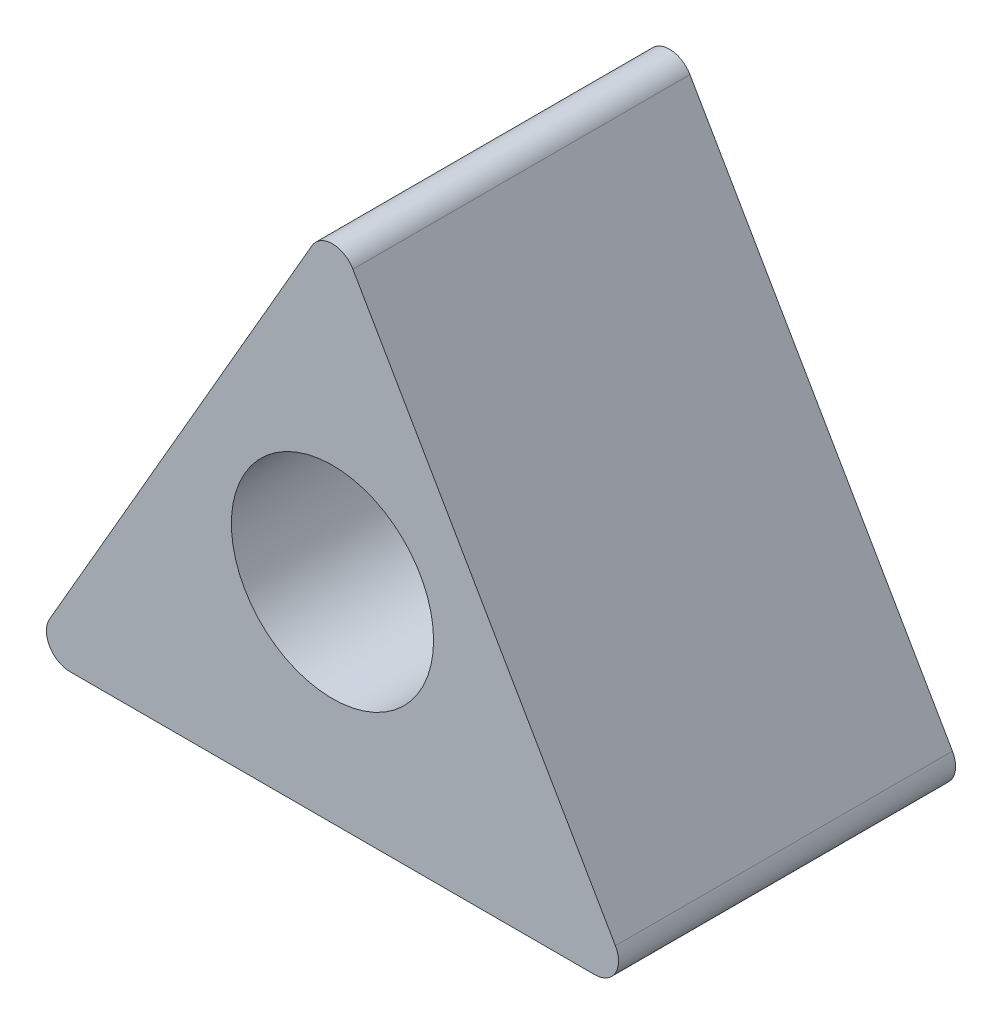
ISO-10303-21;
HEADER;
FILE_DESCRIPTION(('STEP AP214'),'2;1');
FILE_NAME('part.step','',(''),(''),'','','');
FILE_SCHEMA(('AUTOMOTIVE_DESIGN { 1 0 10303 214 1 1 1 1 }'));
ENDSEC;
DATA;
#1=APPLICATION_CONTEXT('core data for automotive mechanical design processes');
#2=APPLICATION_PROTOCOL_DEFINITION('international standard','automotive_design',2000,#1);
#3=PRODUCT_CONTEXT('',#1,'mechanical');
#4=PRODUCT('Part','Part','',(#3));
#5=PRODUCT_RELATED_PRODUCT_CATEGORY('part','',(#4));
#6=PRODUCT_DEFINITION_FORMATION('','',#4);
#7=PRODUCT_DEFINITION_CONTEXT('part definition',#1,'design');
#8=PRODUCT_DEFINITION('design','',#6,#7);
#9=PRODUCT_DEFINITION_SHAPE('','',#8);
#10=(LENGTH_UNIT() NAMED_UNIT(*) SI_UNIT(.MILLI.,.METRE.));
#11=(NAMED_UNIT(*) PLANE_ANGLE_UNIT() SI_UNIT($,.RADIAN.));
#12=(NAMED_UNIT(*) SI_UNIT($,.STERADIAN.) SOLID_ANGLE_UNIT());
#13=UNCERTAINTY_MEASURE_WITH_UNIT(LENGTH_MEASURE(1.E-05),#10,'distance_accuracy_value','');
#14=(GEOMETRIC_REPRESENTATION_CONTEXT(3) GLOBAL_UNCERTAINTY_ASSIGNED_CONTEXT((#13)) GLOBAL_UNIT_ASSIGNED_CONTEXT((#10,
#11,#12)) REPRESENTATION_CONTEXT('',''));
#15=CARTESIAN_POINT('',(0.,0.,0.));
#16=DIRECTION('',(0.,0.,1.));
#17=DIRECTION('',(1.,0.,0.));
#18=AXIS2_PLACEMENT_3D('',#15,#16,#17);
#19=CARTESIAN_POINT('',(0.,0.,50.));
#20=DIRECTION('',(0.,0.,-1.));
#21=DIRECTION('',(-1.,0.,0.));
#22=AXIS2_PLACEMENT_3D('',#19,#20,#21);
#23=PLANE('',#22);
#24=DIRECTION('',(-0.499989161803219,-0.866031661129843,0.));
#25=VECTOR('',#24,1.);
#26=CARTESIAN_POINT('',(0.,0.,50.));
#27=LINE('',#26,#25);
#28=CARTESIAN_POINT('',(41.9680013521204,72.6928115685453,50.));
#29=VERTEX_POINT('',#28);
#30=CARTESIAN_POINT('',(3.03102321016933,5.25003793314056,50.));
#31=VERTEX_POINT('',#30);
#32=EDGE_CURVE('E104',#29,#31,#27,.T.);
#33=ORIENTED_EDGE('',*,*,#32,.T.);
#34=CARTESIAN_POINT('',(6.06213402412378,3.50007586682929,50.));
#35=DIRECTION('',(0.,0.,-1.));
#36=DIRECTION('',(-1.,0.,0.));
#37=AXIS2_PLACEMENT_3D('',#34,#35,#36);
#38=CIRCLE('',#37,3.5);
#39=CARTESIAN_POINT('',(6.06217782601634,7.58671033804374E-05,50.));
#40=VERTEX_POINT('',#39);
#41=EDGE_CURVE('E11',#31,#40,#38,.F.);
#42=ORIENTED_EDGE('',*,*,#41,.T.);
#43=DIRECTION('',(0.999999999921689,1.25148264455236E-05,0.));
#44=VECTOR('',#43,1.);
#45=CARTESIAN_POINT('',(0.,0.,50.));
#46=LINE('',#45,#44);
#47=CARTESIAN_POINT('',(83.9378221669357,0.00105046727671669,50.));
#48=VERTEX_POINT('',#47);
#49=EDGE_CURVE('E142',#40,#48,#46,.T.);
#50=ORIENTED_EDGE('',*,*,#49,.T.);
#51=CARTESIAN_POINT('',(83.9377783650432,3.50105046700264,50.));
#52=DIRECTION('',(0.,0.,-1.));
#53=DIRECTION('',(-1.,0.,0.));
#54=AXIS2_PLACEMENT_3D('',#51,#52,#53);
#55=CIRCLE('',#54,3.5);
#56=CARTESIAN_POINT('',(86.968845377105,5.2510884004173,50.));
#57=VERTEX_POINT('',#56);
#58=EDGE_CURVE('E133',#48,#57,#55,.F.);
#59=ORIENTED_EDGE('',*,*,#58,.T.);
#60=DIRECTION('',(-0.500010838118471,0.866019146303397,0.));
#61=VECTOR('',#60,1.);
#62=CARTESIAN_POINT('',(44.9990245622897,77.9428495016858,50.));
#63=LINE('',#62,#61);
#64=CARTESIAN_POINT('',(48.0301791781367,72.6928874356487,50.));
#65=VERTEX_POINT('',#64);
#66=EDGE_CURVE('E105',#57,#65,#63,.T.);
#67=ORIENTED_EDGE('',*,*,#66,.T.);
#68=CARTESIAN_POINT('',(44.9991121660748,70.942849502234,50.));
#69=DIRECTION('',(0.,0.,-1.));
#70=DIRECTION('',(-1.,0.,0.));
#71=AXIS2_PLACEMENT_3D('',#68,#69,#70);
#72=CIRCLE('',#71,3.5);
#73=EDGE_CURVE('E122',#65,#29,#72,.F.);
#74=ORIENTED_EDGE('',*,*,#73,.T.);
#75=EDGE_LOOP('',(#33,#42,#50,#59,#67,#74));
#76=FACE_BOUND('',#75,.T.);
#77=CARTESIAN_POINT('',(45.,31.,50.));
#78=DIRECTION('',(0.,0.,1.));
#79=DIRECTION('',(1.,0.,0.));
#80=AXIS2_PLACEMENT_3D('',#77,#78,#79);
#81=CIRCLE('',#80,15.);
#82=CARTESIAN_POINT('',(60.,31.,50.));
#83=VERTEX_POINT('',#82);
#84=EDGE_CURVE('E110',#83,#83,#81,.T.);
#85=ORIENTED_EDGE('',*,*,#84,.F.);
#86=EDGE_LOOP('',(#85));
#87=FACE_BOUND('',#86,.T.);
#88=ADVANCED_FACE('F39',(#76,#87),#23,.F.);
#89=CARTESIAN_POINT('',(0.,0.,0.));
#90=DIRECTION('',(0.,0.,-1.));
#91=DIRECTION('',(-1.,0.,0.));
#92=AXIS2_PLACEMENT_3D('',#89,#90,#91);
#93=PLANE('',#92);
#94=DIRECTION('',(0.999999999921689,1.25148264455236E-05,0.));
#95=VECTOR('',#94,1.);
#96=CARTESIAN_POINT('',(0.,0.,0.));
#97=LINE('',#96,#95);
#98=CARTESIAN_POINT('',(6.06217782601634,7.58671033804374E-05,0.));
#99=VERTEX_POINT('',#98);
#100=CARTESIAN_POINT('',(83.9378221669357,0.00105046727671669,0.));
#101=VERTEX_POINT('',#100);
#102=EDGE_CURVE('E109',#99,#101,#97,.T.);
#103=ORIENTED_EDGE('',*,*,#102,.F.);
#104=CARTESIAN_POINT('',(6.06213402412378,3.50007586682929,0.));
#105=DIRECTION('',(0.,0.,-1.));
#106=DIRECTION('',(-1.,0.,0.));
#107=AXIS2_PLACEMENT_3D('',#104,#105,#106);
#108=CIRCLE('',#107,3.5);
#109=CARTESIAN_POINT('',(3.03102321016933,5.25003793314056,0.));
#110=VERTEX_POINT('',#109);
#111=EDGE_CURVE('E61',#99,#110,#108,.T.);
#112=ORIENTED_EDGE('',*,*,#111,.T.);
#113=DIRECTION('',(-0.499989161803219,-0.866031661129843,0.));
#114=VECTOR('',#113,1.);
#115=CARTESIAN_POINT('',(0.,0.,0.));
#116=LINE('',#115,#114);
#117=CARTESIAN_POINT('',(41.9680013521204,72.6928115685453,0.));
#118=VERTEX_POINT('',#117);
#119=EDGE_CURVE('E103',#118,#110,#116,.T.);
#120=ORIENTED_EDGE('',*,*,#119,.F.);
#121=CARTESIAN_POINT('',(44.9991121660748,70.942849502234,0.));
#122=DIRECTION('',(0.,0.,-1.));
#123=DIRECTION('',(-1.,0.,0.));
#124=AXIS2_PLACEMENT_3D('',#121,#122,#123);
#125=CIRCLE('',#124,3.5);
#126=CARTESIAN_POINT('',(48.0301791781367,72.6928874356487,0.));
#127=VERTEX_POINT('',#126);
#128=EDGE_CURVE('E93',#118,#127,#125,.T.);
#129=ORIENTED_EDGE('',*,*,#128,.T.);
#130=DIRECTION('',(-0.500010838118471,0.866019146303397,0.));
#131=VECTOR('',#130,1.);
#132=CARTESIAN_POINT('',(44.9990245622897,77.9428495016858,0.));
#133=LINE('',#132,#131);
#134=CARTESIAN_POINT('',(86.968845377105,5.2510884004173,0.));
#135=VERTEX_POINT('',#134);
#136=EDGE_CURVE('E112',#135,#127,#133,.T.);
#137=ORIENTED_EDGE('',*,*,#136,.F.);
#138=CARTESIAN_POINT('',(83.9377783650432,3.50105046700264,0.));
#139=DIRECTION('',(0.,0.,-1.));
#140=DIRECTION('',(-1.,0.,0.));
#141=AXIS2_PLACEMENT_3D('',#138,#139,#140);
#142=CIRCLE('',#141,3.5);
#143=EDGE_CURVE('E127',#135,#101,#142,.T.);
#144=ORIENTED_EDGE('',*,*,#143,.T.);
#145=EDGE_LOOP('',(#103,#112,#120,#129,#137,#144));
#146=FACE_BOUND('',#145,.T.);
#147=CARTESIAN_POINT('',(45.,31.,0.));
#148=DIRECTION('',(0.,0.,1.));
#149=DIRECTION('',(1.,0.,0.));
#150=AXIS2_PLACEMENT_3D('',#147,#148,#149);
#151=CIRCLE('',#150,15.);
#152=CARTESIAN_POINT('',(60.,31.,0.));
#153=VERTEX_POINT('',#152);
#154=EDGE_CURVE('E115',#153,#153,#151,.T.);
#155=ORIENTED_EDGE('',*,*,#154,.T.);
#156=EDGE_LOOP('',(#155));
#157=FACE_BOUND('',#156,.T.);
#158=ADVANCED_FACE('F107',(#146,#157),#93,.T.);
#159=CARTESIAN_POINT('',(0.,0.,50.));
#160=DIRECTION('',(0.866031661129843,-0.499989161803219,0.));
#161=DIRECTION('',(0.499989161803219,0.866031661129843,0.));
#162=AXIS2_PLACEMENT_3D('',#159,#160,#161);
#163=PLANE('',#162);
#164=ORIENTED_EDGE('',*,*,#119,.T.);
#165=DIRECTION('',(0.,0.,-1.));
#166=VECTOR('',#165,1.);
#167=CARTESIAN_POINT('',(3.03102321016933,5.25003793314056,50.));
#168=LINE('',#167,#166);
#169=EDGE_CURVE('E47',#110,#31,#168,.F.);
#170=ORIENTED_EDGE('',*,*,#169,.T.);
#171=ORIENTED_EDGE('',*,*,#32,.F.);
#172=DIRECTION('',(0.,0.,-1.));
#173=VECTOR('',#172,1.);
#174=CARTESIAN_POINT('',(41.9680013521204,72.6928115685453,50.));
#175=LINE('',#174,#173);
#176=EDGE_CURVE('E97',#29,#118,#175,.T.);
#177=ORIENTED_EDGE('',*,*,#176,.T.);
#178=EDGE_LOOP('',(#164,#170,#171,#177));
#179=FACE_BOUND('',#178,.T.);
#180=ADVANCED_FACE('F102',(#179),#163,.F.);
#181=CARTESIAN_POINT('',(0.,0.,50.));
#182=DIRECTION('',(-1.25148264455236E-05,0.99999999992169,0.));
#183=DIRECTION('',(-0.99999999992169,-1.25148264455236E-05,0.));
#184=AXIS2_PLACEMENT_3D('',#181,#182,#183);
#185=PLANE('',#184);
#186=ORIENTED_EDGE('',*,*,#49,.F.);
#187=DIRECTION('',(0.,0.,-1.));
#188=VECTOR('',#187,1.);
#189=CARTESIAN_POINT('',(6.06217782601634,7.58671033804374E-05,50.));
#190=LINE('',#189,#188);
#191=EDGE_CURVE('E135',#40,#99,#190,.T.);
#192=ORIENTED_EDGE('',*,*,#191,.T.);
#193=ORIENTED_EDGE('',*,*,#102,.T.);
#194=DIRECTION('',(0.,0.,-1.));
#195=VECTOR('',#194,1.);
#196=CARTESIAN_POINT('',(83.9378221669357,0.00105046727671669,50.));
#197=LINE('',#196,#195);
#198=EDGE_CURVE('E130',#101,#48,#197,.F.);
#199=ORIENTED_EDGE('',*,*,#198,.T.);
#200=EDGE_LOOP('',(#186,#192,#193,#199));
#201=FACE_BOUND('',#200,.T.);
#202=ADVANCED_FACE('F141',(#201),#185,.F.);
#203=CARTESIAN_POINT('',(44.9990245622897,77.9428495016858,50.));
#204=DIRECTION('',(-0.866019146303397,-0.500010838118471,0.));
#205=DIRECTION('',(0.500010838118471,-0.866019146303397,0.));
#206=AXIS2_PLACEMENT_3D('',#203,#204,#205);
#207=PLANE('',#206);
#208=ORIENTED_EDGE('',*,*,#66,.F.);
#209=DIRECTION('',(0.,0.,-1.));
#210=VECTOR('',#209,1.);
#211=CARTESIAN_POINT('',(86.9688453771051,5.25108840041727,50.));
#212=LINE('',#211,#210);
#213=EDGE_CURVE('E124',#57,#135,#212,.T.);
#214=ORIENTED_EDGE('',*,*,#213,.T.);
#215=ORIENTED_EDGE('',*,*,#136,.T.);
#216=DIRECTION('',(0.,0.,-1.));
#217=VECTOR('',#216,1.);
#218=CARTESIAN_POINT('',(48.0301791781367,72.6928874356487,50.));
#219=LINE('',#218,#217);
#220=EDGE_CURVE('E99',#127,#65,#219,.F.);
#221=ORIENTED_EDGE('',*,*,#220,.T.);
#222=EDGE_LOOP('',(#208,#214,#215,#221));
#223=FACE_BOUND('',#222,.T.);
#224=ADVANCED_FACE('F154',(#223),#207,.F.);
#225=CARTESIAN_POINT('',(45.,31.,50.));
#226=DIRECTION('',(0.,0.,-1.));
#227=DIRECTION('',(-1.,0.,0.));
#228=AXIS2_PLACEMENT_3D('',#225,#226,#227);
#229=CYLINDRICAL_SURFACE('',#228,15.);
#230=ORIENTED_EDGE('',*,*,#84,.T.);
#231=EDGE_LOOP('',(#230));
#232=FACE_BOUND('',#231,.T.);
#233=ORIENTED_EDGE('',*,*,#154,.F.);
#234=EDGE_LOOP('',(#233));
#235=FACE_BOUND('',#234,.T.);
#236=ADVANCED_FACE('F160',(#232,#235),#229,.F.);
#237=CARTESIAN_POINT('',(44.9991121660748,70.942849502234,50.));
#238=DIRECTION('',(0.,0.,-1.));
#239=DIRECTION('',(-1.,0.,0.));
#240=AXIS2_PLACEMENT_3D('',#237,#238,#239);
#241=CYLINDRICAL_SURFACE('',#240,3.5);
#242=ORIENTED_EDGE('',*,*,#73,.F.);
#243=ORIENTED_EDGE('',*,*,#220,.F.);
#244=ORIENTED_EDGE('',*,*,#128,.F.);
#245=ORIENTED_EDGE('',*,*,#176,.F.);
#246=EDGE_LOOP('',(#242,#243,#244,#245));
#247=FACE_BOUND('',#246,.T.);
#248=ADVANCED_FACE('F96',(#247),#241,.T.);
#249=CARTESIAN_POINT('',(83.9377783650432,3.50105046700264,50.));
#250=DIRECTION('',(0.,0.,-1.));
#251=DIRECTION('',(-1.,0.,0.));
#252=AXIS2_PLACEMENT_3D('',#249,#250,#251);
#253=CYLINDRICAL_SURFACE('',#252,3.5);
#254=ORIENTED_EDGE('',*,*,#58,.F.);
#255=ORIENTED_EDGE('',*,*,#198,.F.);
#256=ORIENTED_EDGE('',*,*,#143,.F.);
#257=ORIENTED_EDGE('',*,*,#213,.F.);
#258=EDGE_LOOP('',(#254,#255,#256,#257));
#259=FACE_BOUND('',#258,.T.);
#260=ADVANCED_FACE('F149',(#259),#253,.T.);
#261=CARTESIAN_POINT('',(6.06213402412378,3.50007586682929,50.));
#262=DIRECTION('',(0.,0.,-1.));
#263=DIRECTION('',(-1.,0.,0.));
#264=AXIS2_PLACEMENT_3D('',#261,#262,#263);
#265=CYLINDRICAL_SURFACE('',#264,3.5);
#266=ORIENTED_EDGE('',*,*,#41,.F.);
#267=ORIENTED_EDGE('',*,*,#169,.F.);
#268=ORIENTED_EDGE('',*,*,#111,.F.);
#269=ORIENTED_EDGE('',*,*,#191,.F.);
#270=EDGE_LOOP('',(#266,#267,#268,#269));
#271=FACE_BOUND('',#270,.T.);
#272=ADVANCED_FACE('F41',(#271),#265,.T.);
#273=CLOSED_SHELL('',(#88,#158,#180,#202,#224,#236,#248,#260,#272));
#274=MANIFOLD_SOLID_BREP('B2',#273);
#275=ADVANCED_BREP_SHAPE_REPRESENTATION('',(#18,#274),#14);
#276=SHAPE_DEFINITION_REPRESENTATION(#9,#275);
ENDSEC;
END-ISO-10303-21;
